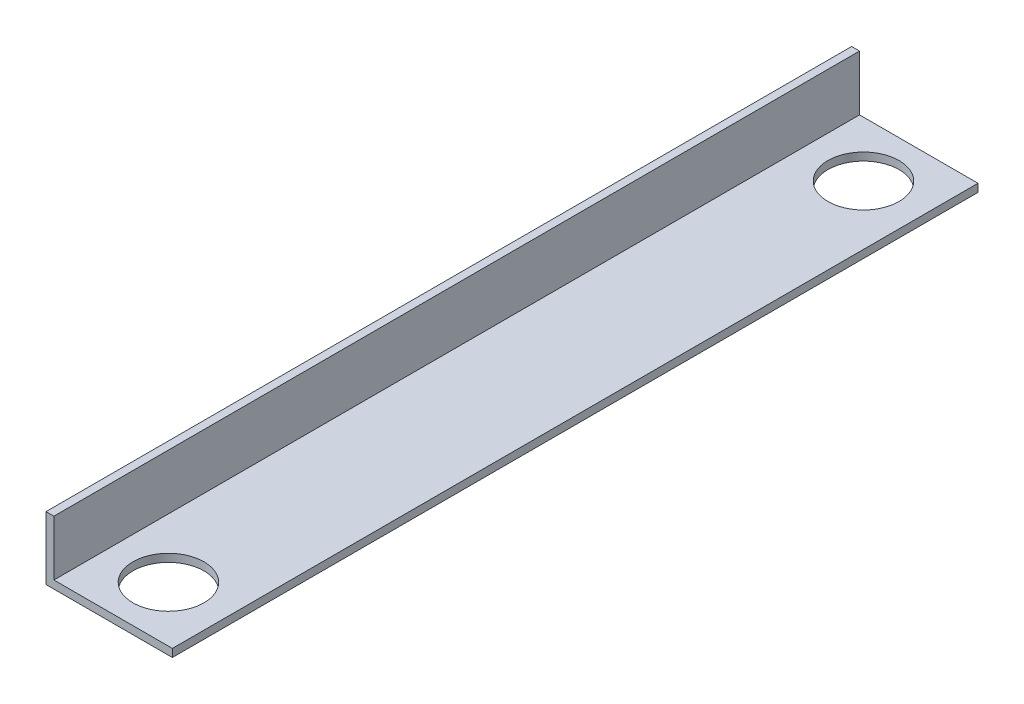
ISO-10303-21;
HEADER;
FILE_DESCRIPTION(('STEP AP214'),'2;1');
FILE_NAME('part.step','',(''),(''),'','','');
FILE_SCHEMA(('AUTOMOTIVE_DESIGN { 1 0 10303 214 1 1 1 1 }'));
ENDSEC;
DATA;
#1=APPLICATION_CONTEXT('core data for automotive mechanical design processes');
#2=APPLICATION_PROTOCOL_DEFINITION('international standard','automotive_design',2000,#1);
#3=PRODUCT_CONTEXT('',#1,'mechanical');
#4=PRODUCT('Part','Part','',(#3));
#5=PRODUCT_RELATED_PRODUCT_CATEGORY('part','',(#4));
#6=PRODUCT_DEFINITION_FORMATION('','',#4);
#7=PRODUCT_DEFINITION_CONTEXT('part definition',#1,'design');
#8=PRODUCT_DEFINITION('design','',#6,#7);
#9=PRODUCT_DEFINITION_SHAPE('','',#8);
#10=(LENGTH_UNIT() NAMED_UNIT(*) SI_UNIT(.MILLI.,.METRE.));
#11=(NAMED_UNIT(*) PLANE_ANGLE_UNIT() SI_UNIT($,.RADIAN.));
#12=(NAMED_UNIT(*) SI_UNIT($,.STERADIAN.) SOLID_ANGLE_UNIT());
#13=UNCERTAINTY_MEASURE_WITH_UNIT(LENGTH_MEASURE(1.E-05),#10,'distance_accuracy_value','');
#14=(GEOMETRIC_REPRESENTATION_CONTEXT(3) GLOBAL_UNCERTAINTY_ASSIGNED_CONTEXT((#13)) GLOBAL_UNIT_ASSIGNED_CONTEXT((#10,
#11,#12)) REPRESENTATION_CONTEXT('',''));
#15=CARTESIAN_POINT('',(0.,0.,0.));
#16=DIRECTION('',(0.,0.,1.));
#17=DIRECTION('',(1.,0.,0.));
#18=AXIS2_PLACEMENT_3D('',#15,#16,#17);
#19=CARTESIAN_POINT('',(0.,0.,323.85));
#20=DIRECTION('',(1.,0.,0.));
#21=DIRECTION('',(0.,0.,-1.));
#22=AXIS2_PLACEMENT_3D('',#19,#20,#21);
#23=PLANE('',#22);
#24=DIRECTION('',(0.,-1.,0.));
#25=VECTOR('',#24,1.);
#26=CARTESIAN_POINT('',(0.,0.,0.));
#27=LINE('',#26,#25);
#28=CARTESIAN_POINT('',(0.,25.4,0.));
#29=VERTEX_POINT('',#28);
#30=CARTESIAN_POINT('',(0.,0.,0.));
#31=VERTEX_POINT('',#30);
#32=EDGE_CURVE('E117',#29,#31,#27,.T.);
#33=ORIENTED_EDGE('',*,*,#32,.T.);
#34=DIRECTION('',(0.,0.,-1.));
#35=VECTOR('',#34,1.);
#36=CARTESIAN_POINT('',(0.,0.,323.85));
#37=LINE('',#36,#35);
#38=CARTESIAN_POINT('',(0.,0.,323.85));
#39=VERTEX_POINT('',#38);
#40=EDGE_CURVE('E11',#39,#31,#37,.T.);
#41=ORIENTED_EDGE('',*,*,#40,.F.);
#42=DIRECTION('',(0.,-1.,0.));
#43=VECTOR('',#42,1.);
#44=CARTESIAN_POINT('',(0.,0.,323.85));
#45=LINE('',#44,#43);
#46=CARTESIAN_POINT('',(0.,25.4,323.85));
#47=VERTEX_POINT('',#46);
#48=EDGE_CURVE('E128',#47,#39,#45,.T.);
#49=ORIENTED_EDGE('',*,*,#48,.F.);
#50=DIRECTION('',(0.,0.,-1.));
#51=VECTOR('',#50,1.);
#52=CARTESIAN_POINT('',(0.,25.4,323.85));
#53=LINE('',#52,#51);
#54=EDGE_CURVE('E113',#47,#29,#53,.T.);
#55=ORIENTED_EDGE('',*,*,#54,.T.);
#56=EDGE_LOOP('',(#33,#41,#49,#55));
#57=FACE_BOUND('',#56,.T.);
#58=ADVANCED_FACE('F33',(#57),#23,.F.);
#59=CARTESIAN_POINT('',(0.,0.,323.85));
#60=DIRECTION('',(0.,1.,0.));
#61=DIRECTION('',(0.,0.,1.));
#62=AXIS2_PLACEMENT_3D('',#59,#60,#61);
#63=PLANE('',#62);
#64=CARTESIAN_POINT('',(26.9875,0.,22.225));
#65=DIRECTION('',(0.,1.,0.));
#66=DIRECTION('',(-1.,0.,0.));
#67=AXIS2_PLACEMENT_3D('',#64,#65,#66);
#68=CIRCLE('',#67,14.2875);
#69=CARTESIAN_POINT('',(12.7,0.,22.225));
#70=VERTEX_POINT('',#69);
#71=EDGE_CURVE('E176',#70,#70,#68,.T.);
#72=ORIENTED_EDGE('',*,*,#71,.T.);
#73=EDGE_LOOP('',(#72));
#74=FACE_BOUND('',#73,.T.);
#75=CARTESIAN_POINT('',(26.9875,0.,301.625));
#76=DIRECTION('',(0.,1.,0.));
#77=DIRECTION('',(-1.,0.,0.));
#78=AXIS2_PLACEMENT_3D('',#75,#76,#77);
#79=CIRCLE('',#78,14.2875);
#80=CARTESIAN_POINT('',(12.7,0.,301.625));
#81=VERTEX_POINT('',#80);
#82=EDGE_CURVE('E121',#81,#81,#79,.T.);
#83=ORIENTED_EDGE('',*,*,#82,.T.);
#84=EDGE_LOOP('',(#83));
#85=FACE_BOUND('',#84,.T.);
#86=DIRECTION('',(1.,0.,0.));
#87=VECTOR('',#86,1.);
#88=CARTESIAN_POINT('',(0.,0.,0.));
#89=LINE('',#88,#87);
#90=CARTESIAN_POINT('',(50.8,0.,0.));
#91=VERTEX_POINT('',#90);
#92=EDGE_CURVE('E120',#31,#91,#89,.T.);
#93=ORIENTED_EDGE('',*,*,#92,.T.);
#94=DIRECTION('',(0.,0.,-1.));
#95=VECTOR('',#94,1.);
#96=CARTESIAN_POINT('',(50.8,0.,323.85));
#97=LINE('',#96,#95);
#98=CARTESIAN_POINT('',(50.8,0.,323.85));
#99=VERTEX_POINT('',#98);
#100=EDGE_CURVE('E41',#99,#91,#97,.T.);
#101=ORIENTED_EDGE('',*,*,#100,.F.);
#102=DIRECTION('',(1.,0.,0.));
#103=VECTOR('',#102,1.);
#104=CARTESIAN_POINT('',(0.,0.,323.85));
#105=LINE('',#104,#103);
#106=EDGE_CURVE('E86',#39,#99,#105,.T.);
#107=ORIENTED_EDGE('',*,*,#106,.F.);
#108=ORIENTED_EDGE('',*,*,#40,.T.);
#109=EDGE_LOOP('',(#93,#101,#107,#108));
#110=FACE_BOUND('',#109,.T.);
#111=ADVANCED_FACE('F152',(#74,#85,#110),#63,.F.);
#112=CARTESIAN_POINT('',(50.8,0.,323.85));
#113=DIRECTION('',(-1.,0.,0.));
#114=DIRECTION('',(0.,0.,1.));
#115=AXIS2_PLACEMENT_3D('',#112,#113,#114);
#116=PLANE('',#115);
#117=DIRECTION('',(0.,1.,0.));
#118=VECTOR('',#117,1.);
#119=CARTESIAN_POINT('',(50.8,0.,0.));
#120=LINE('',#119,#118);
#121=CARTESIAN_POINT('',(50.8,3.175,0.));
#122=VERTEX_POINT('',#121);
#123=EDGE_CURVE('E123',#91,#122,#120,.T.);
#124=ORIENTED_EDGE('',*,*,#123,.T.);
#125=DIRECTION('',(0.,0.,-1.));
#126=VECTOR('',#125,1.);
#127=CARTESIAN_POINT('',(50.8,3.175,323.85));
#128=LINE('',#127,#126);
#129=CARTESIAN_POINT('',(50.8,3.175,323.85));
#130=VERTEX_POINT('',#129);
#131=EDGE_CURVE('E108',#130,#122,#128,.T.);
#132=ORIENTED_EDGE('',*,*,#131,.F.);
#133=DIRECTION('',(0.,1.,0.));
#134=VECTOR('',#133,1.);
#135=CARTESIAN_POINT('',(50.8,0.,323.85));
#136=LINE('',#135,#134);
#137=EDGE_CURVE('E99',#99,#130,#136,.T.);
#138=ORIENTED_EDGE('',*,*,#137,.F.);
#139=ORIENTED_EDGE('',*,*,#100,.T.);
#140=EDGE_LOOP('',(#124,#132,#138,#139));
#141=FACE_BOUND('',#140,.T.);
#142=ADVANCED_FACE('F134',(#141),#116,.F.);
#143=CARTESIAN_POINT('',(50.8,3.175,323.85));
#144=DIRECTION('',(0.,-1.,0.));
#145=DIRECTION('',(1.,0.,0.));
#146=AXIS2_PLACEMENT_3D('',#143,#144,#145);
#147=PLANE('',#146);
#148=CARTESIAN_POINT('',(26.9875,3.175,22.225));
#149=DIRECTION('',(0.,1.,0.));
#150=DIRECTION('',(-1.,0.,0.));
#151=AXIS2_PLACEMENT_3D('',#148,#149,#150);
#152=CIRCLE('',#151,14.2875);
#153=CARTESIAN_POINT('',(12.7,3.175,22.225));
#154=VERTEX_POINT('',#153);
#155=EDGE_CURVE('E171',#154,#154,#152,.T.);
#156=ORIENTED_EDGE('',*,*,#155,.F.);
#157=EDGE_LOOP('',(#156));
#158=FACE_BOUND('',#157,.T.);
#159=CARTESIAN_POINT('',(26.9875,3.175,301.625));
#160=DIRECTION('',(0.,1.,0.));
#161=DIRECTION('',(-1.,0.,0.));
#162=AXIS2_PLACEMENT_3D('',#159,#160,#161);
#163=CIRCLE('',#162,14.2875);
#164=CARTESIAN_POINT('',(12.7,3.175,301.625));
#165=VERTEX_POINT('',#164);
#166=EDGE_CURVE('E174',#165,#165,#163,.T.);
#167=ORIENTED_EDGE('',*,*,#166,.F.);
#168=EDGE_LOOP('',(#167));
#169=FACE_BOUND('',#168,.T.);
#170=DIRECTION('',(-1.,0.,0.));
#171=VECTOR('',#170,1.);
#172=CARTESIAN_POINT('',(50.8,3.175,0.));
#173=LINE('',#172,#171);
#174=CARTESIAN_POINT('',(3.175,3.175,0.));
#175=VERTEX_POINT('',#174);
#176=EDGE_CURVE('E107',#122,#175,#173,.T.);
#177=ORIENTED_EDGE('',*,*,#176,.T.);
#178=DIRECTION('',(0.,0.,-1.));
#179=VECTOR('',#178,1.);
#180=CARTESIAN_POINT('',(3.175,3.175,323.85));
#181=LINE('',#180,#179);
#182=CARTESIAN_POINT('',(3.175,3.175,323.85));
#183=VERTEX_POINT('',#182);
#184=EDGE_CURVE('E104',#183,#175,#181,.T.);
#185=ORIENTED_EDGE('',*,*,#184,.F.);
#186=DIRECTION('',(-1.,0.,0.));
#187=VECTOR('',#186,1.);
#188=CARTESIAN_POINT('',(50.8,3.175,323.85));
#189=LINE('',#188,#187);
#190=EDGE_CURVE('E93',#130,#183,#189,.T.);
#191=ORIENTED_EDGE('',*,*,#190,.F.);
#192=ORIENTED_EDGE('',*,*,#131,.T.);
#193=EDGE_LOOP('',(#177,#185,#191,#192));
#194=FACE_BOUND('',#193,.T.);
#195=ADVANCED_FACE('F105',(#158,#169,#194),#147,.F.);
#196=CARTESIAN_POINT('',(3.175,25.4,323.85));
#197=DIRECTION('',(-1.,0.,0.));
#198=DIRECTION('',(0.,-1.,0.));
#199=AXIS2_PLACEMENT_3D('',#196,#197,#198);
#200=PLANE('',#199);
#201=DIRECTION('',(0.,1.,0.));
#202=VECTOR('',#201,1.);
#203=CARTESIAN_POINT('',(3.175,25.4,0.));
#204=LINE('',#203,#202);
#205=CARTESIAN_POINT('',(3.175,25.4,0.));
#206=VERTEX_POINT('',#205);
#207=EDGE_CURVE('E72',#175,#206,#204,.T.);
#208=ORIENTED_EDGE('',*,*,#207,.T.);
#209=DIRECTION('',(0.,0.,-1.));
#210=VECTOR('',#209,1.);
#211=CARTESIAN_POINT('',(3.175,25.4,323.85));
#212=LINE('',#211,#210);
#213=CARTESIAN_POINT('',(3.175,25.4,323.85));
#214=VERTEX_POINT('',#213);
#215=EDGE_CURVE('E109',#214,#206,#212,.T.);
#216=ORIENTED_EDGE('',*,*,#215,.F.);
#217=DIRECTION('',(0.,1.,0.));
#218=VECTOR('',#217,1.);
#219=CARTESIAN_POINT('',(3.175,25.4,323.85));
#220=LINE('',#219,#218);
#221=EDGE_CURVE('E97',#183,#214,#220,.T.);
#222=ORIENTED_EDGE('',*,*,#221,.F.);
#223=ORIENTED_EDGE('',*,*,#184,.T.);
#224=EDGE_LOOP('',(#208,#216,#222,#223));
#225=FACE_BOUND('',#224,.T.);
#226=ADVANCED_FACE('F111',(#225),#200,.F.);
#227=CARTESIAN_POINT('',(0.,25.4,323.85));
#228=DIRECTION('',(0.,-1.,0.));
#229=DIRECTION('',(0.,0.,-1.));
#230=AXIS2_PLACEMENT_3D('',#227,#228,#229);
#231=PLANE('',#230);
#232=DIRECTION('',(-1.,0.,0.));
#233=VECTOR('',#232,1.);
#234=CARTESIAN_POINT('',(0.,25.4,0.));
#235=LINE('',#234,#233);
#236=EDGE_CURVE('E78',#206,#29,#235,.T.);
#237=ORIENTED_EDGE('',*,*,#236,.T.);
#238=ORIENTED_EDGE('',*,*,#54,.F.);
#239=DIRECTION('',(-1.,0.,0.));
#240=VECTOR('',#239,1.);
#241=CARTESIAN_POINT('',(0.,25.4,323.85));
#242=LINE('',#241,#240);
#243=EDGE_CURVE('E49',#214,#47,#242,.T.);
#244=ORIENTED_EDGE('',*,*,#243,.F.);
#245=ORIENTED_EDGE('',*,*,#215,.T.);
#246=EDGE_LOOP('',(#237,#238,#244,#245));
#247=FACE_BOUND('',#246,.T.);
#248=ADVANCED_FACE('F141',(#247),#231,.F.);
#249=CARTESIAN_POINT('',(0.,0.,323.85));
#250=DIRECTION('',(0.,0.,-1.));
#251=DIRECTION('',(-1.,0.,0.));
#252=AXIS2_PLACEMENT_3D('',#249,#250,#251);
#253=PLANE('',#252);
#254=ORIENTED_EDGE('',*,*,#48,.T.);
#255=ORIENTED_EDGE('',*,*,#106,.T.);
#256=ORIENTED_EDGE('',*,*,#137,.T.);
#257=ORIENTED_EDGE('',*,*,#190,.T.);
#258=ORIENTED_EDGE('',*,*,#221,.T.);
#259=ORIENTED_EDGE('',*,*,#243,.T.);
#260=EDGE_LOOP('',(#254,#255,#256,#257,#258,#259));
#261=FACE_BOUND('',#260,.T.);
#262=ADVANCED_FACE('F95',(#261),#253,.F.);
#263=CARTESIAN_POINT('',(0.,0.,0.));
#264=DIRECTION('',(0.,0.,-1.));
#265=DIRECTION('',(-1.,0.,0.));
#266=AXIS2_PLACEMENT_3D('',#263,#264,#265);
#267=PLANE('',#266);
#268=ORIENTED_EDGE('',*,*,#32,.F.);
#269=ORIENTED_EDGE('',*,*,#236,.F.);
#270=ORIENTED_EDGE('',*,*,#207,.F.);
#271=ORIENTED_EDGE('',*,*,#176,.F.);
#272=ORIENTED_EDGE('',*,*,#123,.F.);
#273=ORIENTED_EDGE('',*,*,#92,.F.);
#274=EDGE_LOOP('',(#268,#269,#270,#271,#272,#273));
#275=FACE_BOUND('',#274,.T.);
#276=ADVANCED_FACE('F137',(#275),#267,.T.);
#277=CARTESIAN_POINT('',(26.9875,0.,301.625));
#278=DIRECTION('',(0.,1.,0.));
#279=DIRECTION('',(-1.,0.,0.));
#280=AXIS2_PLACEMENT_3D('',#277,#278,#279);
#281=CYLINDRICAL_SURFACE('',#280,14.2875);
#282=ORIENTED_EDGE('',*,*,#82,.F.);
#283=EDGE_LOOP('',(#282));
#284=FACE_BOUND('',#283,.T.);
#285=ORIENTED_EDGE('',*,*,#166,.T.);
#286=EDGE_LOOP('',(#285));
#287=FACE_BOUND('',#286,.T.);
#288=ADVANCED_FACE('F187',(#284,#287),#281,.F.);
#289=CARTESIAN_POINT('',(26.9875,0.,22.225));
#290=DIRECTION('',(0.,1.,0.));
#291=DIRECTION('',(-1.,0.,0.));
#292=AXIS2_PLACEMENT_3D('',#289,#290,#291);
#293=CYLINDRICAL_SURFACE('',#292,14.2875);
#294=ORIENTED_EDGE('',*,*,#71,.F.);
#295=EDGE_LOOP('',(#294));
#296=FACE_BOUND('',#295,.T.);
#297=ORIENTED_EDGE('',*,*,#155,.T.);
#298=EDGE_LOOP('',(#297));
#299=FACE_BOUND('',#298,.T.);
#300=ADVANCED_FACE('F185',(#296,#299),#293,.F.);
#301=CLOSED_SHELL('',(#58,#111,#142,#195,#226,#248,#262,#276,#288,#300));
#302=MANIFOLD_SOLID_BREP('B2',#301);
#303=ADVANCED_BREP_SHAPE_REPRESENTATION('',(#18,#302),#14);
#304=SHAPE_DEFINITION_REPRESENTATION(#9,#303);
ENDSEC;
END-ISO-10303-21;
